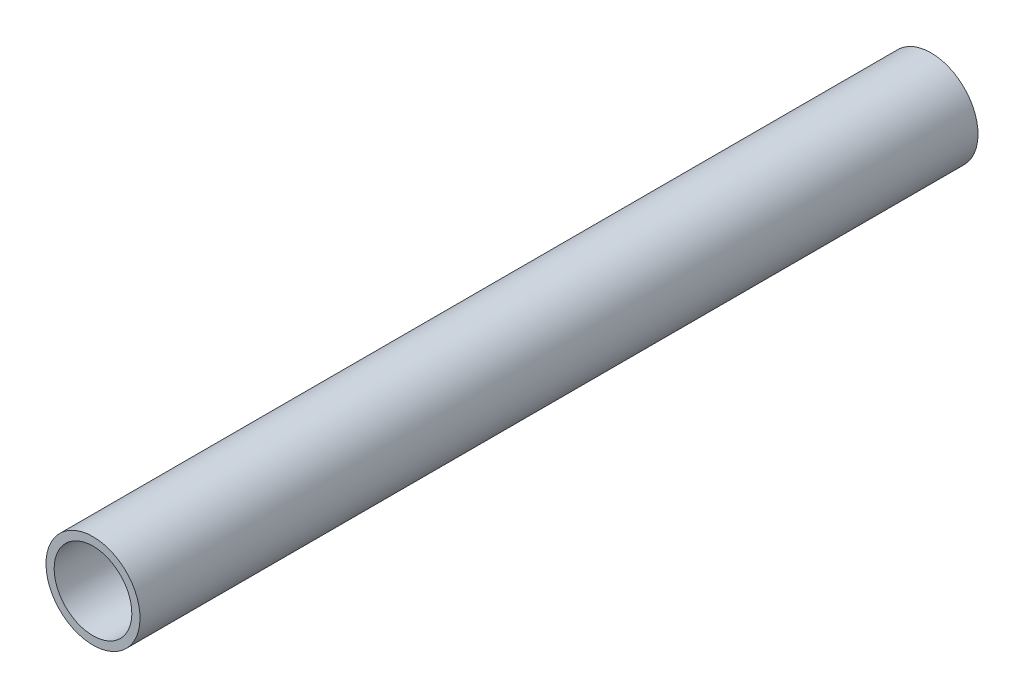
ISO-10303-21;
HEADER;
FILE_DESCRIPTION(('STEP AP214'),'2;1');
FILE_NAME('part.step','',(''),(''),'','','');
FILE_SCHEMA(('AUTOMOTIVE_DESIGN { 1 0 10303 214 1 1 1 1 }'));
ENDSEC;
DATA;
#1=APPLICATION_CONTEXT('core data for automotive mechanical design processes');
#2=APPLICATION_PROTOCOL_DEFINITION('international standard','automotive_design',2000,#1);
#3=PRODUCT_CONTEXT('',#1,'mechanical');
#4=PRODUCT('Part','Part','',(#3));
#5=PRODUCT_RELATED_PRODUCT_CATEGORY('part','',(#4));
#6=PRODUCT_DEFINITION_FORMATION('','',#4);
#7=PRODUCT_DEFINITION_CONTEXT('part definition',#1,'design');
#8=PRODUCT_DEFINITION('design','',#6,#7);
#9=PRODUCT_DEFINITION_SHAPE('','',#8);
#10=(LENGTH_UNIT() NAMED_UNIT(*) SI_UNIT(.MILLI.,.METRE.));
#11=(NAMED_UNIT(*) PLANE_ANGLE_UNIT() SI_UNIT($,.RADIAN.));
#12=(NAMED_UNIT(*) SI_UNIT($,.STERADIAN.) SOLID_ANGLE_UNIT());
#13=UNCERTAINTY_MEASURE_WITH_UNIT(LENGTH_MEASURE(1.E-05),#10,'distance_accuracy_value','');
#14=(GEOMETRIC_REPRESENTATION_CONTEXT(3) GLOBAL_UNCERTAINTY_ASSIGNED_CONTEXT((#13)) GLOBAL_UNIT_ASSIGNED_CONTEXT((#10,
#11,#12)) REPRESENTATION_CONTEXT('',''));
#15=CARTESIAN_POINT('',(0.,0.,0.));
#16=DIRECTION('',(0.,0.,1.));
#17=DIRECTION('',(1.,0.,0.));
#18=AXIS2_PLACEMENT_3D('',#15,#16,#17);
#19=CARTESIAN_POINT('',(-4.42277101670265E-13,0.,2.));
#20=DIRECTION('',(0.,0.,1.));
#21=DIRECTION('',(1.,0.,0.));
#22=AXIS2_PLACEMENT_3D('',#19,#20,#21);
#23=PLANE('',#22);
#24=CARTESIAN_POINT('',(-4.42277101670265E-13,0.,2.));
#25=DIRECTION('',(0.,0.,1.));
#26=DIRECTION('',(0.866025403784439,-0.5,0.));
#27=AXIS2_PLACEMENT_3D('',#24,#25,#26);
#28=CIRCLE('',#27,0.95);
#29=CARTESIAN_POINT('',(0.822724133594775,-0.475000000000083,2.));
#30=VERTEX_POINT('',#29);
#31=EDGE_CURVE('E11',#30,#30,#28,.T.);
#32=ORIENTED_EDGE('',*,*,#31,.T.);
#33=EDGE_LOOP('',(#32));
#34=FACE_BOUND('',#33,.T.);
#35=CARTESIAN_POINT('',(-4.42277101670265E-13,0.,2.));
#36=DIRECTION('',(0.,0.,1.));
#37=DIRECTION('',(0.866025403784439,-0.5,0.));
#38=AXIS2_PLACEMENT_3D('',#35,#36,#37);
#39=CIRCLE('',#38,1.15);
#40=CARTESIAN_POINT('',(0.995929214351662,-0.575000000000083,2.));
#41=VERTEX_POINT('',#40);
#42=EDGE_CURVE('E55',#41,#41,#39,.T.);
#43=ORIENTED_EDGE('',*,*,#42,.F.);
#44=EDGE_LOOP('',(#43));
#45=FACE_BOUND('',#44,.T.);
#46=ADVANCED_FACE('F17',(#34,#45),#23,.F.);
#47=CARTESIAN_POINT('',(-4.42277101670265E-13,0.,22.5));
#48=DIRECTION('',(0.,0.,1.));
#49=DIRECTION('',(1.,0.,0.));
#50=AXIS2_PLACEMENT_3D('',#47,#48,#49);
#51=PLANE('',#50);
#52=CARTESIAN_POINT('',(-4.42277101670265E-13,0.,22.5));
#53=DIRECTION('',(0.,0.,1.));
#54=DIRECTION('',(0.866025403784439,-0.5,0.));
#55=AXIS2_PLACEMENT_3D('',#52,#53,#54);
#56=CIRCLE('',#55,0.95);
#57=CARTESIAN_POINT('',(0.822724133594775,-0.475000000000083,22.5));
#58=VERTEX_POINT('',#57);
#59=EDGE_CURVE('E25',#58,#58,#56,.T.);
#60=ORIENTED_EDGE('',*,*,#59,.F.);
#61=EDGE_LOOP('',(#60));
#62=FACE_BOUND('',#61,.T.);
#63=CARTESIAN_POINT('',(-4.42277101670265E-13,0.,22.5));
#64=DIRECTION('',(0.,0.,1.));
#65=DIRECTION('',(0.866025403784439,-0.5,0.));
#66=AXIS2_PLACEMENT_3D('',#63,#64,#65);
#67=CIRCLE('',#66,1.15);
#68=CARTESIAN_POINT('',(0.995929214351662,-0.575000000000083,22.5));
#69=VERTEX_POINT('',#68);
#70=EDGE_CURVE('E51',#69,#69,#67,.T.);
#71=ORIENTED_EDGE('',*,*,#70,.T.);
#72=EDGE_LOOP('',(#71));
#73=FACE_BOUND('',#72,.T.);
#74=ADVANCED_FACE('F52',(#62,#73),#51,.T.);
#75=CARTESIAN_POINT('',(-4.42277101670265E-13,0.,24.5));
#76=DIRECTION('',(0.,0.,-1.));
#77=DIRECTION('',(0.866025403784439,-0.5,0.));
#78=AXIS2_PLACEMENT_3D('',#75,#76,#77);
#79=CYLINDRICAL_SURFACE('',#78,0.95);
#80=ORIENTED_EDGE('',*,*,#31,.F.);
#81=EDGE_LOOP('',(#80));
#82=FACE_BOUND('',#81,.T.);
#83=ORIENTED_EDGE('',*,*,#59,.T.);
#84=EDGE_LOOP('',(#83));
#85=FACE_BOUND('',#84,.T.);
#86=ADVANCED_FACE('F78',(#82,#85),#79,.F.);
#87=CARTESIAN_POINT('',(-4.42277101670265E-13,0.,24.5));
#88=DIRECTION('',(0.,0.,-1.));
#89=DIRECTION('',(0.866025403784439,-0.5,0.));
#90=AXIS2_PLACEMENT_3D('',#87,#88,#89);
#91=CYLINDRICAL_SURFACE('',#90,1.15);
#92=ORIENTED_EDGE('',*,*,#42,.T.);
#93=EDGE_LOOP('',(#92));
#94=FACE_BOUND('',#93,.T.);
#95=ORIENTED_EDGE('',*,*,#70,.F.);
#96=EDGE_LOOP('',(#95));
#97=FACE_BOUND('',#96,.T.);
#98=ADVANCED_FACE('F73',(#94,#97),#91,.T.);
#99=CLOSED_SHELL('',(#46,#74,#86,#98));
#100=MANIFOLD_SOLID_BREP('B1',#99);
#101=ADVANCED_BREP_SHAPE_REPRESENTATION('',(#18,#100),#14);
#102=SHAPE_DEFINITION_REPRESENTATION(#9,#101);
ENDSEC;
END-ISO-10303-21;
